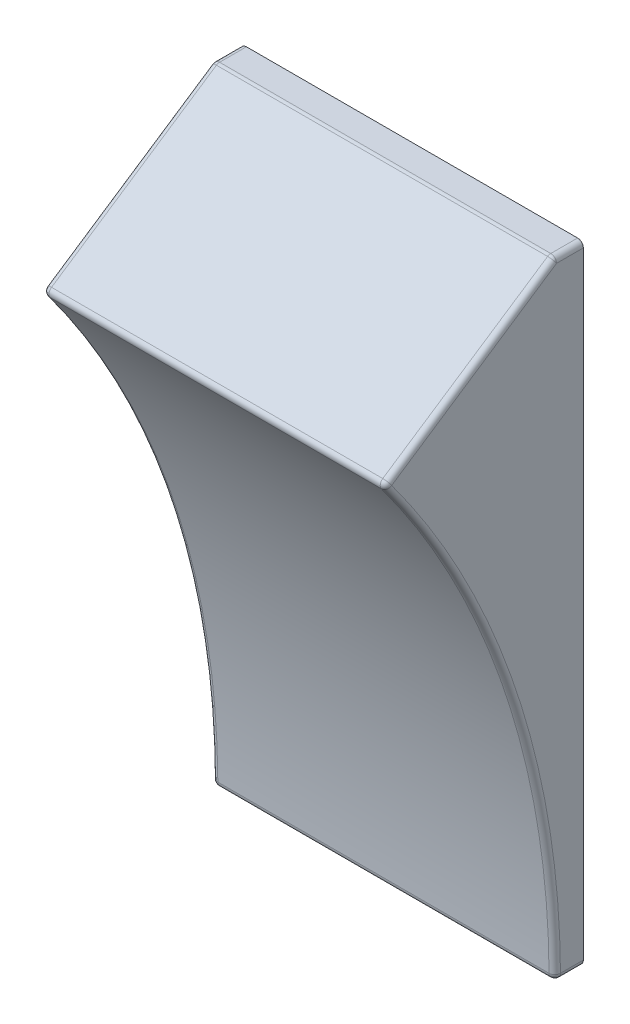
ISO-10303-21;
HEADER;
FILE_DESCRIPTION(('STEP AP214'),'2;1');
FILE_NAME('part.step','',(''),(''),'','','');
FILE_SCHEMA(('AUTOMOTIVE_DESIGN { 1 0 10303 214 1 1 1 1 }'));
ENDSEC;
DATA;
#1=APPLICATION_CONTEXT('core data for automotive mechanical design processes');
#2=APPLICATION_PROTOCOL_DEFINITION('international standard','automotive_design',2000,#1);
#3=PRODUCT_CONTEXT('',#1,'mechanical');
#4=PRODUCT('Part','Part','',(#3));
#5=PRODUCT_RELATED_PRODUCT_CATEGORY('part','',(#4));
#6=PRODUCT_DEFINITION_FORMATION('','',#4);
#7=PRODUCT_DEFINITION_CONTEXT('part definition',#1,'design');
#8=PRODUCT_DEFINITION('design','',#6,#7);
#9=PRODUCT_DEFINITION_SHAPE('','',#8);
#10=(LENGTH_UNIT() NAMED_UNIT(*) SI_UNIT(.MILLI.,.METRE.));
#11=(NAMED_UNIT(*) PLANE_ANGLE_UNIT() SI_UNIT($,.RADIAN.));
#12=(NAMED_UNIT(*) SI_UNIT($,.STERADIAN.) SOLID_ANGLE_UNIT());
#13=UNCERTAINTY_MEASURE_WITH_UNIT(LENGTH_MEASURE(1.E-05),#10,'distance_accuracy_value','');
#14=(GEOMETRIC_REPRESENTATION_CONTEXT(3) GLOBAL_UNCERTAINTY_ASSIGNED_CONTEXT((#13)) GLOBAL_UNIT_ASSIGNED_CONTEXT((#10,
#11,#12)) REPRESENTATION_CONTEXT('',''));
#15=CARTESIAN_POINT('',(0.,0.,0.));
#16=DIRECTION('',(0.,0.,1.));
#17=DIRECTION('',(1.,0.,0.));
#18=AXIS2_PLACEMENT_3D('',#15,#16,#17);
#19=CARTESIAN_POINT('',(116.333744279938,111.99204329235,112.551305344825));
#20=DIRECTION('',(0.,-1.,0.));
#21=DIRECTION('',(0.,0.,-1.));
#22=AXIS2_PLACEMENT_3D('',#19,#20,#21);
#23=PLANE('',#22);
#24=DIRECTION('',(-1.,0.,0.));
#25=VECTOR('',#24,1.);
#26=CARTESIAN_POINT('',(116.333744279938,111.99204329235,112.081582908599));
#27=LINE('',#26,#25);
#28=CARTESIAN_POINT('',(116.233744279938,111.99204329235,112.081582908599));
#29=VERTEX_POINT('',#28);
#30=CARTESIAN_POINT('',(110.433744279938,111.99204329235,112.081582908599));
#31=VERTEX_POINT('',#30);
#32=EDGE_CURVE('E11',#29,#31,#27,.T.);
#33=ORIENTED_EDGE('',*,*,#32,.T.);
#34=DIRECTION('',(0.,0.,1.));
#35=VECTOR('',#34,1.);
#36=CARTESIAN_POINT('',(110.433744279938,111.99204329235,112.551305344825));
#37=LINE('',#36,#35);
#38=CARTESIAN_POINT('',(110.433744279938,111.99204329235,112.551305344825));
#39=VERTEX_POINT('',#38);
#40=EDGE_CURVE('E55',#31,#39,#37,.T.);
#41=ORIENTED_EDGE('',*,*,#40,.T.);
#42=DIRECTION('',(-1.,0.,0.));
#43=VECTOR('',#42,1.);
#44=CARTESIAN_POINT('',(116.333744279938,111.99204329235,112.551305344825));
#45=LINE('',#44,#43);
#46=CARTESIAN_POINT('',(116.233744279938,111.99204329235,112.551305344825));
#47=VERTEX_POINT('',#46);
#48=EDGE_CURVE('E276',#47,#39,#45,.T.);
#49=ORIENTED_EDGE('',*,*,#48,.F.);
#50=DIRECTION('',(0.,0.,-1.));
#51=VECTOR('',#50,1.);
#52=CARTESIAN_POINT('',(116.233744279938,111.99204329235,112.551305344825));
#53=LINE('',#52,#51);
#54=EDGE_CURVE('E230',#47,#29,#53,.T.);
#55=ORIENTED_EDGE('',*,*,#54,.T.);
#56=EDGE_LOOP('',(#33,#41,#49,#55));
#57=FACE_BOUND('',#56,.T.);
#58=ADVANCED_FACE('F44',(#57),#23,.F.);
#59=CARTESIAN_POINT('',(116.333744279938,111.89204329235,112.551305344825));
#60=DIRECTION('',(-1.,0.,0.));
#61=DIRECTION('',(0.,-1.,0.));
#62=AXIS2_PLACEMENT_3D('',#59,#60,#61);
#63=CYLINDRICAL_SURFACE('',#62,0.100000000000003);
#64=ORIENTED_EDGE('',*,*,#48,.T.);
#65=CARTESIAN_POINT('',(110.433744279938,111.89204329235,112.551305344825));
#66=DIRECTION('',(1.,0.,0.));
#67=DIRECTION('',(0.,-1.,4.16333634234422E-13));
#68=AXIS2_PLACEMENT_3D('',#65,#66,#67);
#69=CIRCLE('',#68,0.100000000000003);
#70=CARTESIAN_POINT('',(110.433744279938,111.975248321784,112.606775364448));
#71=VERTEX_POINT('',#70);
#72=EDGE_CURVE('E239',#39,#71,#69,.T.);
#73=ORIENTED_EDGE('',*,*,#72,.T.);
#74=DIRECTION('',(-1.,0.,0.));
#75=VECTOR('',#74,1.);
#76=CARTESIAN_POINT('',(116.333744279938,111.975248321784,112.606775364448));
#77=LINE('',#76,#75);
#78=CARTESIAN_POINT('',(116.233744279938,111.975248321784,112.606775364448));
#79=VERTEX_POINT('',#78);
#80=EDGE_CURVE('E240',#79,#71,#77,.T.);
#81=ORIENTED_EDGE('',*,*,#80,.F.);
#82=CARTESIAN_POINT('',(116.233744279938,111.89204329235,112.551305344825));
#83=DIRECTION('',(-1.,0.,0.));
#84=DIRECTION('',(0.,-1.,0.));
#85=AXIS2_PLACEMENT_3D('',#82,#83,#84);
#86=CIRCLE('',#85,0.100000000000003);
#87=EDGE_CURVE('E236',#79,#47,#86,.T.);
#88=ORIENTED_EDGE('',*,*,#87,.T.);
#89=EDGE_LOOP('',(#64,#73,#81,#88));
#90=FACE_BOUND('',#89,.T.);
#91=ADVANCED_FACE('F348',(#90),#63,.T.);
#92=CARTESIAN_POINT('',(116.333744279938,111.975248321784,112.606775364448));
#93=DIRECTION('',(0.,-0.832050294337844,-0.554700196225229));
#94=DIRECTION('',(0.,0.554700196225229,-0.832050294337844));
#95=AXIS2_PLACEMENT_3D('',#92,#93,#94);
#96=PLANE('',#95);
#97=ORIENTED_EDGE('',*,*,#80,.T.);
#98=DIRECTION('',(0.,-0.554700196225229,0.832050294337844));
#99=VECTOR('',#98,1.);
#100=CARTESIAN_POINT('',(110.433744279938,110.050475027332,115.493935306127));
#101=LINE('',#100,#99);
#102=CARTESIAN_POINT('',(110.433744279938,110.050475027332,115.493935306127));
#103=VERTEX_POINT('',#102);
#104=EDGE_CURVE('E282',#71,#103,#101,.T.);
#105=ORIENTED_EDGE('',*,*,#104,.T.);
#106=DIRECTION('',(-1.,0.,0.));
#107=VECTOR('',#106,1.);
#108=CARTESIAN_POINT('',(116.333744279938,110.050475027332,115.493935306127));
#109=LINE('',#108,#107);
#110=CARTESIAN_POINT('',(116.233744279938,110.050475027332,115.493935306127));
#111=VERTEX_POINT('',#110);
#112=EDGE_CURVE('E212',#111,#103,#109,.T.);
#113=ORIENTED_EDGE('',*,*,#112,.F.);
#114=DIRECTION('',(0.,0.554700196225229,-0.832050294337844));
#115=VECTOR('',#114,1.);
#116=CARTESIAN_POINT('',(116.233744279938,111.975248321784,112.606775364448));
#117=LINE('',#116,#115);
#118=EDGE_CURVE('E248',#111,#79,#117,.T.);
#119=ORIENTED_EDGE('',*,*,#118,.T.);
#120=EDGE_LOOP('',(#97,#105,#113,#119));
#121=FACE_BOUND('',#120,.T.);
#122=ADVANCED_FACE('F343',(#121),#96,.F.);
#123=CARTESIAN_POINT('',(116.333744279938,109.967269997898,115.438465286504));
#124=DIRECTION('',(-1.,0.,0.));
#125=DIRECTION('',(0.,-1.,0.));
#126=AXIS2_PLACEMENT_3D('',#123,#124,#125);
#127=CYLINDRICAL_SURFACE('',#126,0.100000000000003);
#128=ORIENTED_EDGE('',*,*,#112,.T.);
#129=CARTESIAN_POINT('',(110.433744279938,109.967269997898,115.438465286504));
#130=DIRECTION('',(1.,0.,0.));
#131=DIRECTION('',(0.,-1.,0.));
#132=AXIS2_PLACEMENT_3D('',#129,#130,#131);
#133=CIRCLE('',#132,0.100000000000003);
#134=CARTESIAN_POINT('',(110.433744279938,109.907831410444,115.518883284001));
#135=VERTEX_POINT('',#134);
#136=EDGE_CURVE('E209',#103,#135,#133,.T.);
#137=ORIENTED_EDGE('',*,*,#136,.T.);
#138=DIRECTION('',(-1.,0.,0.));
#139=VECTOR('',#138,1.);
#140=CARTESIAN_POINT('',(116.333744279938,109.907831410444,115.518883284001));
#141=LINE('',#140,#139);
#142=CARTESIAN_POINT('',(116.233744279938,109.907831410444,115.518883284001));
#143=VERTEX_POINT('',#142);
#144=EDGE_CURVE('E298',#143,#135,#141,.T.);
#145=ORIENTED_EDGE('',*,*,#144,.F.);
#146=CARTESIAN_POINT('',(116.233744279938,109.967269997898,115.438465286504));
#147=DIRECTION('',(-1.,0.,0.));
#148=DIRECTION('',(0.,-1.,0.));
#149=AXIS2_PLACEMENT_3D('',#146,#147,#148);
#150=CIRCLE('',#149,0.100000000000003);
#151=EDGE_CURVE('E213',#143,#111,#150,.T.);
#152=ORIENTED_EDGE('',*,*,#151,.T.);
#153=EDGE_LOOP('',(#128,#137,#145,#152));
#154=FACE_BOUND('',#153,.T.);
#155=ADVANCED_FACE('F46',(#154),#127,.T.);
#156=CARTESIAN_POINT('',(116.333744279938,100.99204329235,127.581582908599));
#157=DIRECTION('',(-1.,0.,0.));
#158=DIRECTION('',(0.,-1.,0.));
#159=AXIS2_PLACEMENT_3D('',#156,#157,#158);
#160=CYLINDRICAL_SURFACE('',#159,15.);
#161=ORIENTED_EDGE('',*,*,#144,.T.);
#162=CARTESIAN_POINT('',(110.433744279938,100.99204329235,127.581582908599));
#163=DIRECTION('',(-1.,0.,0.));
#164=DIRECTION('',(0.,-1.,0.));
#165=AXIS2_PLACEMENT_3D('',#162,#163,#164);
#166=CIRCLE('',#165,15.);
#167=CARTESIAN_POINT('',(110.433744279938,101.091381040695,112.581911845147));
#168=VERTEX_POINT('',#167);
#169=EDGE_CURVE('E285',#135,#168,#166,.T.);
#170=ORIENTED_EDGE('',*,*,#169,.T.);
#171=DIRECTION('',(-1.,0.,0.));
#172=VECTOR('',#171,1.);
#173=CARTESIAN_POINT('',(116.333744279938,101.091381040695,112.581911845147));
#174=LINE('',#173,#172);
#175=CARTESIAN_POINT('',(116.233744279938,101.091381040695,112.581911845147));
#176=VERTEX_POINT('',#175);
#177=EDGE_CURVE('E286',#176,#168,#174,.T.);
#178=ORIENTED_EDGE('',*,*,#177,.F.);
#179=CARTESIAN_POINT('',(116.233744279938,100.99204329235,127.581582908599));
#180=DIRECTION('',(1.,0.,0.));
#181=DIRECTION('',(0.,-1.,0.));
#182=AXIS2_PLACEMENT_3D('',#179,#180,#181);
#183=CIRCLE('',#182,15.);
#184=EDGE_CURVE('E283',#176,#143,#183,.T.);
#185=ORIENTED_EDGE('',*,*,#184,.T.);
#186=EDGE_LOOP('',(#161,#170,#178,#185));
#187=FACE_BOUND('',#186,.T.);
#188=ADVANCED_FACE('F408',(#187),#160,.F.);
#189=CARTESIAN_POINT('',(116.333744279938,101.09204329235,112.481914038057));
#190=DIRECTION('',(-1.,0.,0.));
#191=DIRECTION('',(0.,-1.,0.));
#192=AXIS2_PLACEMENT_3D('',#189,#190,#191);
#193=CYLINDRICAL_SURFACE('',#192,0.100000000000003);
#194=ORIENTED_EDGE('',*,*,#177,.T.);
#195=CARTESIAN_POINT('',(110.433744279938,101.09204329235,112.481914038057));
#196=DIRECTION('',(1.,0.,0.));
#197=DIRECTION('',(0.,-1.,0.));
#198=AXIS2_PLACEMENT_3D('',#195,#196,#197);
#199=CIRCLE('',#198,0.100000000000003);
#200=CARTESIAN_POINT('',(110.433744279938,100.99204329235,112.481914038057));
#201=VERTEX_POINT('',#200);
#202=EDGE_CURVE('E291',#168,#201,#199,.T.);
#203=ORIENTED_EDGE('',*,*,#202,.T.);
#204=DIRECTION('',(-1.,0.,0.));
#205=VECTOR('',#204,1.);
#206=CARTESIAN_POINT('',(116.333744279938,100.99204329235,112.481914038057));
#207=LINE('',#206,#205);
#208=CARTESIAN_POINT('',(116.233744279938,100.99204329235,112.481914038057));
#209=VERTEX_POINT('',#208);
#210=EDGE_CURVE('E222',#209,#201,#207,.T.);
#211=ORIENTED_EDGE('',*,*,#210,.F.);
#212=CARTESIAN_POINT('',(116.233744279938,101.09204329235,112.481914038057));
#213=DIRECTION('',(-1.,0.,0.));
#214=DIRECTION('',(0.,-1.,0.));
#215=AXIS2_PLACEMENT_3D('',#212,#213,#214);
#216=CIRCLE('',#215,0.100000000000003);
#217=EDGE_CURVE('E244',#209,#176,#216,.T.);
#218=ORIENTED_EDGE('',*,*,#217,.T.);
#219=EDGE_LOOP('',(#194,#203,#211,#218));
#220=FACE_BOUND('',#219,.T.);
#221=ADVANCED_FACE('F404',(#220),#193,.T.);
#222=CARTESIAN_POINT('',(116.333744279938,100.99204329235,112.081582908599));
#223=DIRECTION('',(0.,1.,0.));
#224=DIRECTION('',(1.,0.,0.));
#225=AXIS2_PLACEMENT_3D('',#222,#223,#224);
#226=PLANE('',#225);
#227=ORIENTED_EDGE('',*,*,#210,.T.);
#228=DIRECTION('',(0.,0.,-1.));
#229=VECTOR('',#228,1.);
#230=CARTESIAN_POINT('',(110.433744279938,100.99204329235,112.081582908599));
#231=LINE('',#230,#229);
#232=CARTESIAN_POINT('',(110.433744279938,100.99204329235,112.081582908599));
#233=VERTEX_POINT('',#232);
#234=EDGE_CURVE('E219',#201,#233,#231,.T.);
#235=ORIENTED_EDGE('',*,*,#234,.T.);
#236=DIRECTION('',(-1.,0.,0.));
#237=VECTOR('',#236,1.);
#238=CARTESIAN_POINT('',(116.333744279938,100.99204329235,112.081582908599));
#239=LINE('',#238,#237);
#240=CARTESIAN_POINT('',(116.233744279938,100.99204329235,112.081582908599));
#241=VERTEX_POINT('',#240);
#242=EDGE_CURVE('E172',#241,#233,#239,.T.);
#243=ORIENTED_EDGE('',*,*,#242,.F.);
#244=DIRECTION('',(0.,0.,1.));
#245=VECTOR('',#244,1.);
#246=CARTESIAN_POINT('',(116.233744279938,100.99204329235,112.081582908599));
#247=LINE('',#246,#245);
#248=EDGE_CURVE('E188',#241,#209,#247,.T.);
#249=ORIENTED_EDGE('',*,*,#248,.T.);
#250=EDGE_LOOP('',(#227,#235,#243,#249));
#251=FACE_BOUND('',#250,.T.);
#252=ADVANCED_FACE('F415',(#251),#226,.F.);
#253=CARTESIAN_POINT('',(116.333744279938,111.99204329235,112.081582908599));
#254=DIRECTION('',(0.,0.,1.));
#255=DIRECTION('',(1.,0.,0.));
#256=AXIS2_PLACEMENT_3D('',#253,#254,#255);
#257=PLANE('',#256);
#258=DIRECTION('',(0.,1.,0.));
#259=VECTOR('',#258,1.);
#260=CARTESIAN_POINT('',(110.333744279938,111.99204329235,112.081582908599));
#261=LINE('',#260,#259);
#262=CARTESIAN_POINT('',(110.333744279938,101.09204329235,112.081582908599));
#263=VERTEX_POINT('',#262);
#264=CARTESIAN_POINT('',(110.333744279938,111.89204329235,112.081582908599));
#265=VERTEX_POINT('',#264);
#266=EDGE_CURVE('E169',#263,#265,#261,.T.);
#267=ORIENTED_EDGE('',*,*,#266,.T.);
#268=CARTESIAN_POINT('',(110.433744279938,111.89204329235,112.081582908599));
#269=DIRECTION('',(0.,0.,-1.));
#270=DIRECTION('',(0.,-1.,0.));
#271=AXIS2_PLACEMENT_3D('',#268,#269,#270);
#272=CIRCLE('',#271,0.100000000000003);
#273=EDGE_CURVE('E189',#265,#31,#272,.T.);
#274=ORIENTED_EDGE('',*,*,#273,.T.);
#275=ORIENTED_EDGE('',*,*,#32,.F.);
#276=CARTESIAN_POINT('',(116.233744279938,111.89204329235,112.081582908599));
#277=DIRECTION('',(0.,0.,-1.));
#278=DIRECTION('',(0.,-1.,0.));
#279=AXIS2_PLACEMENT_3D('',#276,#277,#278);
#280=CIRCLE('',#279,0.100000000000003);
#281=CARTESIAN_POINT('',(116.333744279938,111.89204329235,112.081582908599));
#282=VERTEX_POINT('',#281);
#283=EDGE_CURVE('E207',#29,#282,#280,.T.);
#284=ORIENTED_EDGE('',*,*,#283,.T.);
#285=DIRECTION('',(0.,1.,0.));
#286=VECTOR('',#285,1.);
#287=CARTESIAN_POINT('',(116.333744279938,111.99204329235,112.081582908599));
#288=LINE('',#287,#286);
#289=CARTESIAN_POINT('',(116.333744279938,101.09204329235,112.081582908599));
#290=VERTEX_POINT('',#289);
#291=EDGE_CURVE('E177',#290,#282,#288,.T.);
#292=ORIENTED_EDGE('',*,*,#291,.F.);
#293=CARTESIAN_POINT('',(116.233744279938,101.09204329235,112.081582908599));
#294=DIRECTION('',(0.,0.,-1.));
#295=DIRECTION('',(0.,-1.,0.));
#296=AXIS2_PLACEMENT_3D('',#293,#294,#295);
#297=CIRCLE('',#296,0.100000000000003);
#298=EDGE_CURVE('E225',#290,#241,#297,.T.);
#299=ORIENTED_EDGE('',*,*,#298,.T.);
#300=ORIENTED_EDGE('',*,*,#242,.T.);
#301=CARTESIAN_POINT('',(110.433744279938,101.09204329235,112.081582908599));
#302=DIRECTION('',(0.,0.,-1.));
#303=DIRECTION('',(0.,-1.,0.));
#304=AXIS2_PLACEMENT_3D('',#301,#302,#303);
#305=CIRCLE('',#304,0.100000000000003);
#306=EDGE_CURVE('E165',#233,#263,#305,.T.);
#307=ORIENTED_EDGE('',*,*,#306,.T.);
#308=EDGE_LOOP('',(#267,#274,#275,#284,#292,#299,#300,#307));
#309=FACE_BOUND('',#308,.T.);
#310=ADVANCED_FACE('F167',(#309),#257,.F.);
#311=CARTESIAN_POINT('',(116.333744279938,101.09204329235,112.481914038057));
#312=DIRECTION('',(-1.,0.,0.));
#313=DIRECTION('',(0.,0.,1.));
#314=AXIS2_PLACEMENT_3D('',#311,#312,#313);
#315=PLANE('',#314);
#316=ORIENTED_EDGE('',*,*,#291,.T.);
#317=DIRECTION('',(0.,0.,1.));
#318=VECTOR('',#317,1.);
#319=CARTESIAN_POINT('',(116.333744279938,111.89204329235,112.481914038057));
#320=LINE('',#319,#318);
#321=CARTESIAN_POINT('',(116.333744279938,111.89204329235,112.551305344825));
#322=VERTEX_POINT('',#321);
#323=EDGE_CURVE('E214',#282,#322,#320,.T.);
#324=ORIENTED_EDGE('',*,*,#323,.T.);
#325=DIRECTION('',(0.,-0.554700196225229,0.832050294337844));
#326=VECTOR('',#325,1.);
#327=CARTESIAN_POINT('',(116.333744279938,108.600993126243,117.487880593986));
#328=LINE('',#327,#326);
#329=CARTESIAN_POINT('',(116.333744279938,109.967269997898,115.438465286504));
#330=VERTEX_POINT('',#329);
#331=EDGE_CURVE('E217',#322,#330,#328,.T.);
#332=ORIENTED_EDGE('',*,*,#331,.T.);
#333=CARTESIAN_POINT('',(116.333744279938,100.99204329235,127.581582908599));
#334=DIRECTION('',(-1.,0.,0.));
#335=DIRECTION('',(0.,-1.,0.));
#336=AXIS2_PLACEMENT_3D('',#333,#334,#335);
#337=CIRCLE('',#336,15.1);
#338=CARTESIAN_POINT('',(116.333744279938,101.09204329235,112.481914038057));
#339=VERTEX_POINT('',#338);
#340=EDGE_CURVE('E305',#330,#339,#337,.T.);
#341=ORIENTED_EDGE('',*,*,#340,.T.);
#342=DIRECTION('',(0.,0.,-1.));
#343=VECTOR('',#342,1.);
#344=CARTESIAN_POINT('',(116.333744279938,101.09204329235,112.481914038057));
#345=LINE('',#344,#343);
#346=EDGE_CURVE('E294',#339,#290,#345,.T.);
#347=ORIENTED_EDGE('',*,*,#346,.T.);
#348=EDGE_LOOP('',(#316,#324,#332,#341,#347));
#349=FACE_BOUND('',#348,.T.);
#350=ADVANCED_FACE('F379',(#349),#315,.F.);
#351=CARTESIAN_POINT('',(110.333744279938,101.09204329235,112.481914038057));
#352=DIRECTION('',(-1.,0.,0.));
#353=DIRECTION('',(0.,0.,1.));
#354=AXIS2_PLACEMENT_3D('',#351,#352,#353);
#355=PLANE('',#354);
#356=DIRECTION('',(0.,0.554700196225229,-0.832050294337844));
#357=VECTOR('',#356,1.);
#358=CARTESIAN_POINT('',(110.333744279938,111.89204329235,112.551305344825));
#359=LINE('',#358,#357);
#360=CARTESIAN_POINT('',(110.333744279938,109.967269997898,115.438465286504));
#361=VERTEX_POINT('',#360);
#362=CARTESIAN_POINT('',(110.333744279938,111.89204329235,112.551305344825));
#363=VERTEX_POINT('',#362);
#364=EDGE_CURVE('E202',#361,#363,#359,.T.);
#365=ORIENTED_EDGE('',*,*,#364,.T.);
#366=DIRECTION('',(0.,0.,-1.));
#367=VECTOR('',#366,1.);
#368=CARTESIAN_POINT('',(110.333744279938,111.89204329235,112.081582908599));
#369=LINE('',#368,#367);
#370=EDGE_CURVE('E48',#363,#265,#369,.T.);
#371=ORIENTED_EDGE('',*,*,#370,.T.);
#372=ORIENTED_EDGE('',*,*,#266,.F.);
#373=DIRECTION('',(0.,0.,1.));
#374=VECTOR('',#373,1.);
#375=CARTESIAN_POINT('',(110.333744279938,101.09204329235,112.481914038057));
#376=LINE('',#375,#374);
#377=CARTESIAN_POINT('',(110.333744279938,101.09204329235,112.481914038057));
#378=VERTEX_POINT('',#377);
#379=EDGE_CURVE('E184',#263,#378,#376,.T.);
#380=ORIENTED_EDGE('',*,*,#379,.T.);
#381=CARTESIAN_POINT('',(110.333744279938,100.99204329235,127.581582908599));
#382=DIRECTION('',(1.,0.,0.));
#383=DIRECTION('',(0.,-1.,0.));
#384=AXIS2_PLACEMENT_3D('',#381,#382,#383);
#385=CIRCLE('',#384,15.1);
#386=EDGE_CURVE('E196',#378,#361,#385,.T.);
#387=ORIENTED_EDGE('',*,*,#386,.T.);
#388=EDGE_LOOP('',(#365,#371,#372,#380,#387));
#389=FACE_BOUND('',#388,.T.);
#390=ADVANCED_FACE('F182',(#389),#355,.T.);
#391=CARTESIAN_POINT('',(110.433744279938,101.09204329235,112.081582908599));
#392=DIRECTION('',(0.,0.,1.));
#393=DIRECTION('',(0.,-1.,0.));
#394=AXIS2_PLACEMENT_3D('',#391,#392,#393);
#395=CYLINDRICAL_SURFACE('',#394,0.100000000000003);
#396=ORIENTED_EDGE('',*,*,#306,.F.);
#397=ORIENTED_EDGE('',*,*,#234,.F.);
#398=CARTESIAN_POINT('',(110.433744279938,101.09204329235,112.481914038057));
#399=DIRECTION('',(0.,0.,1.));
#400=DIRECTION('',(0.,-1.,0.));
#401=AXIS2_PLACEMENT_3D('',#398,#399,#400);
#402=CIRCLE('',#401,0.100000000000003);
#403=EDGE_CURVE('E193',#378,#201,#402,.T.);
#404=ORIENTED_EDGE('',*,*,#403,.F.);
#405=ORIENTED_EDGE('',*,*,#379,.F.);
#406=EDGE_LOOP('',(#396,#397,#404,#405));
#407=FACE_BOUND('',#406,.T.);
#408=ADVANCED_FACE('F191',(#407),#395,.T.);
#409=CARTESIAN_POINT('',(110.433744279938,101.09204329235,112.481914038057));
#410=DIRECTION('',(0.,0.,1.));
#411=DIRECTION('',(0.,-1.,0.));
#412=AXIS2_PLACEMENT_3D('',#409,#410,#411);
#413=SPHERICAL_SURFACE('',#412,0.1);
#414=ORIENTED_EDGE('',*,*,#403,.T.);
#415=ORIENTED_EDGE('',*,*,#202,.F.);
#416=CARTESIAN_POINT('',(110.433744279938,101.09204329235,112.481914038057));
#417=DIRECTION('',(0.,0.999978070896788,0.006622516556254));
#418=DIRECTION('',(0.,-0.006622516556254,0.999978070896788));
#419=AXIS2_PLACEMENT_3D('',#416,#417,#418);
#420=CIRCLE('',#419,0.0999999999999985);
#421=EDGE_CURVE('E308',#378,#168,#420,.T.);
#422=ORIENTED_EDGE('',*,*,#421,.F.);
#423=EDGE_LOOP('',(#414,#415,#422));
#424=FACE_BOUND('',#423,.T.);
#425=ADVANCED_FACE('F417',(#424),#413,.T.);
#426=CARTESIAN_POINT('',(110.433744279938,100.99204329235,127.581582908599));
#427=DIRECTION('',(-1.,0.,0.));
#428=DIRECTION('',(0.,-1.,0.));
#429=AXIS2_PLACEMENT_3D('',#426,#427,#428);
#430=TOROIDAL_SURFACE('',#429,15.1,0.1);
#431=ORIENTED_EDGE('',*,*,#421,.T.);
#432=ORIENTED_EDGE('',*,*,#169,.F.);
#433=CARTESIAN_POINT('',(110.433744279938,109.967269997898,115.438465286504));
#434=DIRECTION('',(0.,0.804179974973181,0.59438587453954));
#435=DIRECTION('',(0.,-0.59438587453954,0.804179974973181));
#436=AXIS2_PLACEMENT_3D('',#433,#434,#435);
#437=CIRCLE('',#436,0.100000000000002);
#438=EDGE_CURVE('E320',#361,#135,#437,.T.);
#439=ORIENTED_EDGE('',*,*,#438,.F.);
#440=ORIENTED_EDGE('',*,*,#386,.F.);
#441=EDGE_LOOP('',(#431,#432,#439,#440));
#442=FACE_BOUND('',#441,.T.);
#443=ADVANCED_FACE('F359',(#442),#430,.T.);
#444=CARTESIAN_POINT('',(110.433744279938,109.967269997898,115.438465286504));
#445=DIRECTION('',(0.,0.,1.));
#446=DIRECTION('',(0.,-1.,0.));
#447=AXIS2_PLACEMENT_3D('',#444,#445,#446);
#448=SPHERICAL_SURFACE('',#447,0.1);
#449=ORIENTED_EDGE('',*,*,#438,.T.);
#450=ORIENTED_EDGE('',*,*,#136,.F.);
#451=CARTESIAN_POINT('',(110.433744279938,109.967269997898,115.438465286504));
#452=DIRECTION('',(0.,0.554700196225293,-0.832050294337801));
#453=DIRECTION('',(0.,0.832050294337801,0.554700196225293));
#454=AXIS2_PLACEMENT_3D('',#451,#452,#453);
#455=CIRCLE('',#454,0.0999999999999971);
#456=EDGE_CURVE('E324',#361,#103,#455,.T.);
#457=ORIENTED_EDGE('',*,*,#456,.F.);
#458=EDGE_LOOP('',(#449,#450,#457));
#459=FACE_BOUND('',#458,.T.);
#460=ADVANCED_FACE('F361',(#459),#448,.T.);
#461=CARTESIAN_POINT('',(110.433744279938,111.89204329235,112.551305344825));
#462=DIRECTION('',(0.,0.554700196225293,-0.832050294337801));
#463=DIRECTION('',(0.,0.832050294337801,0.554700196225293));
#464=AXIS2_PLACEMENT_3D('',#461,#462,#463);
#465=CYLINDRICAL_SURFACE('',#464,0.0999999999999971);
#466=ORIENTED_EDGE('',*,*,#456,.T.);
#467=ORIENTED_EDGE('',*,*,#104,.F.);
#468=CARTESIAN_POINT('',(110.433744279938,111.89204329235,112.551305344825));
#469=DIRECTION('',(0.,0.554700196225293,-0.832050294337801));
#470=DIRECTION('',(0.,0.832050294337801,0.554700196225293));
#471=AXIS2_PLACEMENT_3D('',#468,#469,#470);
#472=CIRCLE('',#471,0.0999999999999971);
#473=EDGE_CURVE('E312',#363,#71,#472,.T.);
#474=ORIENTED_EDGE('',*,*,#473,.F.);
#475=ORIENTED_EDGE('',*,*,#364,.F.);
#476=EDGE_LOOP('',(#466,#467,#474,#475));
#477=FACE_BOUND('',#476,.T.);
#478=ADVANCED_FACE('F355',(#477),#465,.T.);
#479=CARTESIAN_POINT('',(110.433744279938,111.89204329235,112.551305344825));
#480=DIRECTION('',(0.,0.,1.));
#481=DIRECTION('',(0.,-1.,0.));
#482=AXIS2_PLACEMENT_3D('',#479,#480,#481);
#483=SPHERICAL_SURFACE('',#482,0.1);
#484=ORIENTED_EDGE('',*,*,#473,.T.);
#485=ORIENTED_EDGE('',*,*,#72,.F.);
#486=CARTESIAN_POINT('',(110.433744279938,111.89204329235,112.551305344825));
#487=DIRECTION('',(0.,0.,-1.));
#488=DIRECTION('',(0.,1.,0.));
#489=AXIS2_PLACEMENT_3D('',#486,#487,#488);
#490=CIRCLE('',#489,0.100000000000003);
#491=EDGE_CURVE('E309',#363,#39,#490,.T.);
#492=ORIENTED_EDGE('',*,*,#491,.F.);
#493=EDGE_LOOP('',(#484,#485,#492));
#494=FACE_BOUND('',#493,.T.);
#495=ADVANCED_FACE('F352',(#494),#483,.T.);
#496=CARTESIAN_POINT('',(110.433744279938,111.89204329235,112.551305344825));
#497=DIRECTION('',(0.,0.,-1.));
#498=DIRECTION('',(0.,1.,0.));
#499=AXIS2_PLACEMENT_3D('',#496,#497,#498);
#500=CYLINDRICAL_SURFACE('',#499,0.100000000000003);
#501=ORIENTED_EDGE('',*,*,#273,.F.);
#502=ORIENTED_EDGE('',*,*,#370,.F.);
#503=ORIENTED_EDGE('',*,*,#491,.T.);
#504=ORIENTED_EDGE('',*,*,#40,.F.);
#505=EDGE_LOOP('',(#501,#502,#503,#504));
#506=FACE_BOUND('',#505,.T.);
#507=ADVANCED_FACE('F357',(#506),#500,.T.);
#508=CARTESIAN_POINT('',(116.233744279938,101.09204329235,112.481914038057));
#509=DIRECTION('',(0.,0.,-1.));
#510=DIRECTION('',(0.,1.,0.));
#511=AXIS2_PLACEMENT_3D('',#508,#509,#510);
#512=CYLINDRICAL_SURFACE('',#511,0.100000000000003);
#513=CARTESIAN_POINT('',(116.233744279938,101.09204329235,112.481914038057));
#514=DIRECTION('',(0.,0.,1.));
#515=DIRECTION('',(0.,-1.,0.));
#516=AXIS2_PLACEMENT_3D('',#513,#514,#515);
#517=CIRCLE('',#516,0.100000000000003);
#518=EDGE_CURVE('E251',#209,#339,#517,.T.);
#519=ORIENTED_EDGE('',*,*,#518,.F.);
#520=ORIENTED_EDGE('',*,*,#248,.F.);
#521=ORIENTED_EDGE('',*,*,#298,.F.);
#522=ORIENTED_EDGE('',*,*,#346,.F.);
#523=EDGE_LOOP('',(#519,#520,#521,#522));
#524=FACE_BOUND('',#523,.T.);
#525=ADVANCED_FACE('F413',(#524),#512,.T.);
#526=CARTESIAN_POINT('',(116.233744279938,101.09204329235,112.481914038057));
#527=DIRECTION('',(0.,0.,1.));
#528=DIRECTION('',(0.,-1.,0.));
#529=AXIS2_PLACEMENT_3D('',#526,#527,#528);
#530=SPHERICAL_SURFACE('',#529,0.1);
#531=ORIENTED_EDGE('',*,*,#217,.F.);
#532=ORIENTED_EDGE('',*,*,#518,.T.);
#533=CARTESIAN_POINT('',(116.233744279938,101.09204329235,112.481914038057));
#534=DIRECTION('',(0.,0.999978070896788,0.006622516556254));
#535=DIRECTION('',(0.,-0.006622516556254,0.999978070896788));
#536=AXIS2_PLACEMENT_3D('',#533,#534,#535);
#537=CIRCLE('',#536,0.0999999999999985);
#538=EDGE_CURVE('E234',#176,#339,#537,.T.);
#539=ORIENTED_EDGE('',*,*,#538,.F.);
#540=EDGE_LOOP('',(#531,#532,#539));
#541=FACE_BOUND('',#540,.T.);
#542=ADVANCED_FACE('F409',(#541),#530,.T.);
#543=CARTESIAN_POINT('',(116.233744279938,100.99204329235,127.581582908599));
#544=DIRECTION('',(-1.,0.,0.));
#545=DIRECTION('',(0.,-1.,0.));
#546=AXIS2_PLACEMENT_3D('',#543,#544,#545);
#547=TOROIDAL_SURFACE('',#546,15.1,0.1);
#548=CARTESIAN_POINT('',(116.233744279938,109.967269997898,115.438465286504));
#549=DIRECTION('',(0.,0.804179974973181,0.59438587453954));
#550=DIRECTION('',(0.,-0.59438587453954,0.804179974973181));
#551=AXIS2_PLACEMENT_3D('',#548,#549,#550);
#552=CIRCLE('',#551,0.100000000000002);
#553=EDGE_CURVE('E231',#143,#330,#552,.T.);
#554=ORIENTED_EDGE('',*,*,#553,.F.);
#555=ORIENTED_EDGE('',*,*,#184,.F.);
#556=ORIENTED_EDGE('',*,*,#538,.T.);
#557=ORIENTED_EDGE('',*,*,#340,.F.);
#558=EDGE_LOOP('',(#554,#555,#556,#557));
#559=FACE_BOUND('',#558,.T.);
#560=ADVANCED_FACE('F375',(#559),#547,.T.);
#561=CARTESIAN_POINT('',(116.233744279938,109.967269997898,115.438465286504));
#562=DIRECTION('',(0.,0.,1.));
#563=DIRECTION('',(0.,-1.,0.));
#564=AXIS2_PLACEMENT_3D('',#561,#562,#563);
#565=SPHERICAL_SURFACE('',#564,0.1);
#566=ORIENTED_EDGE('',*,*,#151,.F.);
#567=ORIENTED_EDGE('',*,*,#553,.T.);
#568=CARTESIAN_POINT('',(116.233744279938,109.967269997898,115.438465286504));
#569=DIRECTION('',(0.,0.554700196225293,-0.832050294337801));
#570=DIRECTION('',(0.,0.832050294337801,0.554700196225293));
#571=AXIS2_PLACEMENT_3D('',#568,#569,#570);
#572=CIRCLE('',#571,0.0999999999999971);
#573=EDGE_CURVE('E235',#111,#330,#572,.T.);
#574=ORIENTED_EDGE('',*,*,#573,.F.);
#575=EDGE_LOOP('',(#566,#567,#574));
#576=FACE_BOUND('',#575,.T.);
#577=ADVANCED_FACE('F369',(#576),#565,.T.);
#578=CARTESIAN_POINT('',(116.233744279938,108.600993126243,117.487880593986));
#579=DIRECTION('',(0.,-0.554700196225293,0.832050294337801));
#580=DIRECTION('',(0.,-0.832050294337801,-0.554700196225293));
#581=AXIS2_PLACEMENT_3D('',#578,#579,#580);
#582=CYLINDRICAL_SURFACE('',#581,0.0999999999999971);
#583=CARTESIAN_POINT('',(116.233744279938,111.89204329235,112.551305344825));
#584=DIRECTION('',(0.,0.554700196225293,-0.832050294337801));
#585=DIRECTION('',(0.,0.832050294337801,0.554700196225293));
#586=AXIS2_PLACEMENT_3D('',#583,#584,#585);
#587=CIRCLE('',#586,0.0999999999999971);
#588=EDGE_CURVE('E252',#79,#322,#587,.T.);
#589=ORIENTED_EDGE('',*,*,#588,.F.);
#590=ORIENTED_EDGE('',*,*,#118,.F.);
#591=ORIENTED_EDGE('',*,*,#573,.T.);
#592=ORIENTED_EDGE('',*,*,#331,.F.);
#593=EDGE_LOOP('',(#589,#590,#591,#592));
#594=FACE_BOUND('',#593,.T.);
#595=ADVANCED_FACE('F367',(#594),#582,.T.);
#596=CARTESIAN_POINT('',(116.233744279938,111.89204329235,112.551305344825));
#597=DIRECTION('',(0.,0.,1.));
#598=DIRECTION('',(0.,-1.,0.));
#599=AXIS2_PLACEMENT_3D('',#596,#597,#598);
#600=SPHERICAL_SURFACE('',#599,0.1);
#601=ORIENTED_EDGE('',*,*,#87,.F.);
#602=ORIENTED_EDGE('',*,*,#588,.T.);
#603=CARTESIAN_POINT('',(116.233744279938,111.89204329235,112.551305344825));
#604=DIRECTION('',(0.,0.,-1.));
#605=DIRECTION('',(0.,1.,0.));
#606=AXIS2_PLACEMENT_3D('',#603,#604,#605);
#607=CIRCLE('',#606,0.100000000000003);
#608=EDGE_CURVE('E254',#47,#322,#607,.T.);
#609=ORIENTED_EDGE('',*,*,#608,.F.);
#610=EDGE_LOOP('',(#601,#602,#609));
#611=FACE_BOUND('',#610,.T.);
#612=ADVANCED_FACE('F485',(#611),#600,.T.);
#613=CARTESIAN_POINT('',(116.233744279938,111.89204329235,112.481914038057));
#614=DIRECTION('',(0.,0.,1.));
#615=DIRECTION('',(0.,-1.,0.));
#616=AXIS2_PLACEMENT_3D('',#613,#614,#615);
#617=CYLINDRICAL_SURFACE('',#616,0.100000000000003);
#618=ORIENTED_EDGE('',*,*,#283,.F.);
#619=ORIENTED_EDGE('',*,*,#54,.F.);
#620=ORIENTED_EDGE('',*,*,#608,.T.);
#621=ORIENTED_EDGE('',*,*,#323,.F.);
#622=EDGE_LOOP('',(#618,#619,#620,#621));
#623=FACE_BOUND('',#622,.T.);
#624=ADVANCED_FACE('F382',(#623),#617,.T.);
#625=CLOSED_SHELL('',(#58,#91,#122,#155,#188,#221,#252,#310,#350,#390,#408,#425,#443,#460,#478,
#495,#507,#525,#542,#560,#577,#595,#612,#624));
#626=MANIFOLD_SOLID_BREP('B2',#625);
#627=ADVANCED_BREP_SHAPE_REPRESENTATION('',(#18,#626),#14);
#628=SHAPE_DEFINITION_REPRESENTATION(#9,#627);
ENDSEC;
END-ISO-10303-21;
